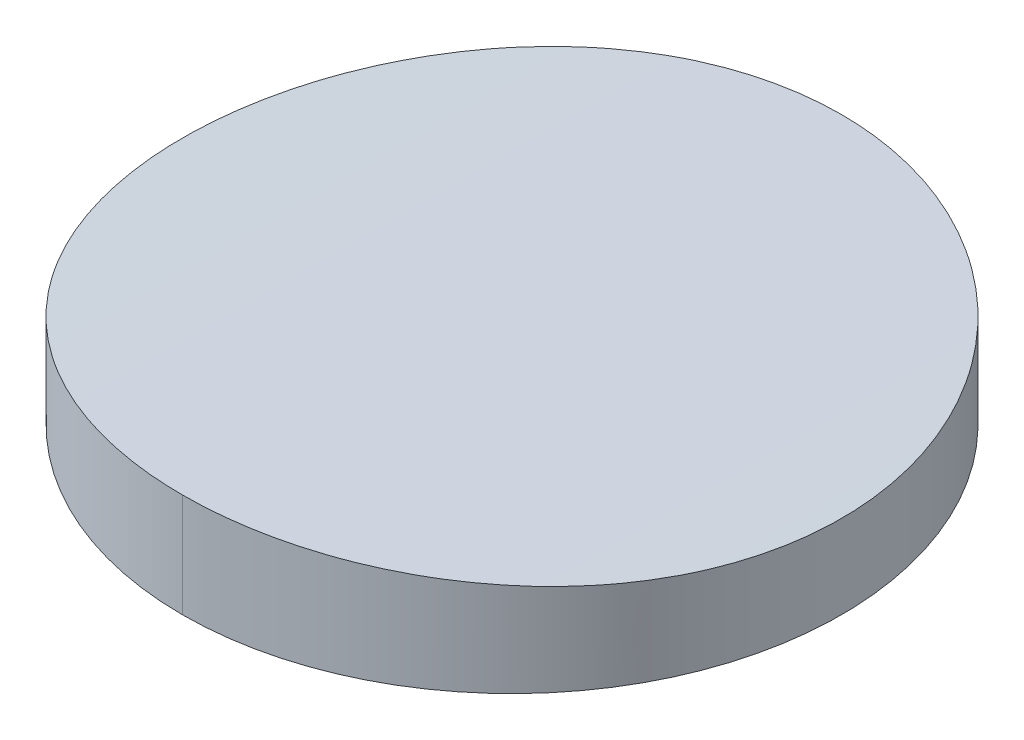
ISO-10303-21;
HEADER;
FILE_DESCRIPTION(('STEP AP214'),'2;1');
FILE_NAME('part.step','',(''),(''),'','','');
FILE_SCHEMA(('AUTOMOTIVE_DESIGN { 1 0 10303 214 1 1 1 1 }'));
ENDSEC;
DATA;
#1=APPLICATION_CONTEXT('core data for automotive mechanical design processes');
#2=APPLICATION_PROTOCOL_DEFINITION('international standard','automotive_design',2000,#1);
#3=PRODUCT_CONTEXT('',#1,'mechanical');
#4=PRODUCT('Part','Part','',(#3));
#5=PRODUCT_RELATED_PRODUCT_CATEGORY('part','',(#4));
#6=PRODUCT_DEFINITION_FORMATION('','',#4);
#7=PRODUCT_DEFINITION_CONTEXT('part definition',#1,'design');
#8=PRODUCT_DEFINITION('design','',#6,#7);
#9=PRODUCT_DEFINITION_SHAPE('','',#8);
#10=(LENGTH_UNIT() NAMED_UNIT(*) SI_UNIT(.MILLI.,.METRE.));
#11=(NAMED_UNIT(*) PLANE_ANGLE_UNIT() SI_UNIT($,.RADIAN.));
#12=(NAMED_UNIT(*) SI_UNIT($,.STERADIAN.) SOLID_ANGLE_UNIT());
#13=UNCERTAINTY_MEASURE_WITH_UNIT(LENGTH_MEASURE(1.E-05),#10,'distance_accuracy_value','');
#14=(GEOMETRIC_REPRESENTATION_CONTEXT(3) GLOBAL_UNCERTAINTY_ASSIGNED_CONTEXT((#13)) GLOBAL_UNIT_ASSIGNED_CONTEXT((#10,
#11,#12)) REPRESENTATION_CONTEXT('',''));
#15=CARTESIAN_POINT('',(0.,0.,0.));
#16=DIRECTION('',(0.,0.,1.));
#17=DIRECTION('',(1.,0.,0.));
#18=AXIS2_PLACEMENT_3D('',#15,#16,#17);
#19=CARTESIAN_POINT('',(0.,2.,0.));
#20=DIRECTION('',(0.,-1.,0.));
#21=DIRECTION('',(0.,0.,-1.));
#22=AXIS2_PLACEMENT_3D('',#19,#20,#21);
#23=CYLINDRICAL_SURFACE('',#22,6.35);
#24=CARTESIAN_POINT('',(0.,1.99999999999999,6.35));
#25=CARTESIAN_POINT('',(0.103842853528296,2.00000108939403,6.35000873743789));
#26=CARTESIAN_POINT('',(0.207687042817171,1.99968705312045,6.34747682567943));
#27=CARTESIAN_POINT('',(0.414884391595368,1.9984379540779,6.33733458540327));
#28=CARTESIAN_POINT('',(0.518238131030155,1.99750431744744,6.32973591888034));
#29=CARTESIAN_POINT('',(0.724451198514081,1.99502503346966,6.30946200413632));
#30=CARTESIAN_POINT('',(0.827310469644072,1.99347931729502,6.29678618499599));
#31=CARTESIAN_POINT('',(1.03253144188486,1.98978649196356,6.26637339123771));
#32=CARTESIAN_POINT('',(1.13489123297501,1.98763787539123,6.24862372851511));
#33=CARTESIAN_POINT('',(1.33889627754905,1.98275443699788,6.20811643418848));
#34=CARTESIAN_POINT('',(1.44053876224624,1.98001800602823,6.18534505091903));
#35=CARTESIAN_POINT('',(1.64234540382485,1.97399568652462,6.13488105520925));
#36=CARTESIAN_POINT('',(1.742512279958,1.970710997741,6.10719918025153));
#37=CARTESIAN_POINT('',(1.9413670229993,1.96361911423562,6.0469264741245));
#38=CARTESIAN_POINT('',(2.04005450755625,1.9598117869342,6.0143343971608));
#39=CARTESIAN_POINT('',(2.23595140438288,1.95170109786126,5.94425371703567));
#40=CARTESIAN_POINT('',(2.3331561652157,1.94739643847559,5.90675226907841));
#41=CARTESIAN_POINT('',(2.52555171552343,1.93834225195972,5.82708588624282));
#42=CARTESIAN_POINT('',(2.62074357953148,1.93359296992572,5.78492351838445));
#43=CARTESIAN_POINT('',(2.80871405649182,1.92370494964381,5.69606761075279));
#44=CARTESIAN_POINT('',(2.90149748050205,1.91856708350654,5.64938415534884));
#45=CARTESIAN_POINT('',(3.08465470283176,1.90794163753951,5.55149781466281));
#46=CARTESIAN_POINT('',(3.17502796272005,1.9024539804794,5.50029393034766));
#47=CARTESIAN_POINT('',(3.3533702503885,1.89116746264935,5.39337823744992));
#48=CARTESIAN_POINT('',(3.44133233859537,1.88536782222045,5.33765493994725));
#49=CARTESIAN_POINT('',(3.61408856255866,1.87354720326617,5.22222365906147));
#50=CARTESIAN_POINT('',(3.69889372150536,1.86752717682495,5.1625320743307));
#51=CARTESIAN_POINT('',(3.8652709772437,1.85531820708541,5.03921133294866));
#52=CARTESIAN_POINT('',(3.94685017709921,1.84912969215878,4.97559172012224));
#53=CARTESIAN_POINT('',(4.10678341026481,1.83662997819599,4.84442554248109));
#54=CARTESIAN_POINT('',(4.18513732085295,1.83031877450497,4.77687882847599));
#55=CARTESIAN_POINT('',(4.33862927917859,1.81761782743431,4.63786851051239));
#56=CARTESIAN_POINT('',(4.41375907888108,1.81122793085914,4.56639581649589));
#57=CARTESIAN_POINT('',(4.5608517690741,1.79840817737677,4.41950205175944));
#58=CARTESIAN_POINT('',(4.63279576781628,1.79197828814912,4.34406206494087));
#59=CARTESIAN_POINT('',(4.77269646472146,1.77919442396298,4.18992384877719));
#60=CARTESIAN_POINT('',(4.84066306515828,1.7728402948393,4.11123462269958));
#61=CARTESIAN_POINT('',(4.97262056012919,1.76025502496192,3.95060723200545));
#62=CARTESIAN_POINT('',(5.03661224119402,1.75402386004443,3.86866971542962));
#63=CARTESIAN_POINT('',(5.16063299400014,1.7417284809773,3.70155453452372));
#64=CARTESIAN_POINT('',(5.22065296331906,1.73566466771221,3.6163700876243));
#65=CARTESIAN_POINT('',(5.33618136526156,1.72380259924905,3.44360506821389));
#66=CARTESIAN_POINT('',(5.39171117185556,1.71800315127833,3.35603886988897));
#67=CARTESIAN_POINT('',(5.49827143955425,1.70671302159509,3.17851523133362));
#68=CARTESIAN_POINT('',(5.54931374262552,1.70122154198214,3.08856495309264));
#69=CARTESIAN_POINT('',(5.64691272928603,1.69058677684858,2.9062808108221));
#70=CARTESIAN_POINT('',(5.69347087522368,1.68544337797763,2.81394773639676));
#71=CARTESIAN_POINT('',(5.78211632292745,1.67554035207542,2.62690481994584));
#72=CARTESIAN_POINT('',(5.82419412626258,1.67078154533751,2.53219043471913));
#73=CARTESIAN_POINT('',(5.9039568739437,1.66167228727416,2.34022936014354));
#74=CARTESIAN_POINT('',(5.94161339308422,1.65732450998601,2.24297073038601));
#75=CARTESIAN_POINT('',(6.01199206450491,1.64913017005306,2.04695987372984));
#76=CARTESIAN_POINT('',(6.04472728200034,1.64528228411336,1.9482123957892));
#77=CARTESIAN_POINT('',(6.10527804367,1.63811482737222,1.74922952208899));
#78=CARTESIAN_POINT('',(6.13309486041466,1.634795119934,1.64899451850344));
#79=CARTESIAN_POINT('',(6.18382513452612,1.62870648590376,1.44704135198037));
#80=CARTESIAN_POINT('',(6.20672769424668,1.62593878435455,1.34532041628709));
#81=CARTESIAN_POINT('',(6.24749004763409,1.62099110073572,1.14113498340212));
#82=CARTESIAN_POINT('',(6.26536283994373,1.61880960438281,1.03867311803696));
#83=CARTESIAN_POINT('',(6.29600845509256,1.61505742083034,0.833220133840947));
#84=CARTESIAN_POINT('',(6.30879299130521,1.61348533097205,0.7302307898939));
#85=CARTESIAN_POINT('',(6.32927640983017,1.61096184213555,0.523726321825312));
#86=CARTESIAN_POINT('',(6.33697461589062,1.61001052569234,0.420211129632656));
#87=CARTESIAN_POINT('',(6.34730169783784,1.60873354147357,0.21265682224641));
#88=CARTESIAN_POINT('',(6.34991741574074,1.60840949764358,0.108617044428807));
#89=CARTESIAN_POINT('',(6.35007922653205,1.60838946433526,-0.0993878774418051));
#90=CARTESIAN_POINT('',(6.34762915838904,1.60869299926337,-0.203353018327471));
#91=CARTESIAN_POINT('',(6.33762069143978,1.60993068153884,-0.410822070082934));
#92=CARTESIAN_POINT('',(6.33007270094894,1.6108635439976,-0.514326489032958));
#93=CARTESIAN_POINT('',(6.30988301744227,1.61335122336833,-0.720873449674944));
#94=CARTESIAN_POINT('',(6.29723919117438,1.61490630075401,-0.823915779634936));
#95=CARTESIAN_POINT('',(6.26686985131586,1.61862548350432,-1.02953951228668));
#96=CARTESIAN_POINT('',(6.24912983979097,1.62079132608326,-1.13211873966093));
#97=CARTESIAN_POINT('',(6.20864727729392,1.62570646671817,-1.33644144177248));
#98=CARTESIAN_POINT('',(6.18589678930965,1.62845669023619,-1.43818332179295));
#99=CARTESIAN_POINT('',(6.13545899020578,1.63451243344224,-1.64020394236672));
#100=CARTESIAN_POINT('',(6.10778163121777,1.63781683294681,-1.74048519960146));
#101=CARTESIAN_POINT('',(6.04750110302257,1.64495544864487,-1.93958670790782));
#102=CARTESIAN_POINT('',(6.01489569773193,1.64878990528211,-2.03840627328045));
#103=CARTESIAN_POINT('',(5.94476858609234,1.65695915555922,-2.2345878970721));
#104=CARTESIAN_POINT('',(5.90723286324355,1.66129537131047,-2.3319448832787));
#105=CARTESIAN_POINT('',(5.82772140293325,1.67038125549509,-2.52406671857803));
#106=CARTESIAN_POINT('',(5.78577609363014,1.67512805497993,-2.61884429843097));
#107=CARTESIAN_POINT('',(5.69738361606861,1.68500942104217,-2.80602924163084));
#108=CARTESIAN_POINT('',(5.65094542050803,1.69014321041304,-2.89844088132842));
#109=CARTESIAN_POINT('',(5.55357562190587,1.70076096181474,-3.08089831350808));
#110=CARTESIAN_POINT('',(5.50264201636315,1.70624507959746,-3.17094302821704));
#111=CARTESIAN_POINT('',(5.39628882170818,1.71752263984193,-3.34867207449418));
#112=CARTESIAN_POINT('',(5.34085685203867,1.7233169199448,-3.43634894127204));
#113=CARTESIAN_POINT('',(5.22555009930528,1.73516704194532,-3.60929115866195));
#114=CARTESIAN_POINT('',(5.16565626307002,1.74122395324804,-3.69454373319206));
#115=CARTESIAN_POINT('',(5.04187819021232,1.75350778237981,-3.86180711310454));
#116=CARTESIAN_POINT('',(4.9780027354592,1.75973431012718,-3.94382444384833));
#117=CARTESIAN_POINT('',(4.84626874227925,1.77231246673427,-4.10462380305244));
#118=CARTESIAN_POINT('',(4.77840909586331,1.77866413006432,-4.18340492108195));
#119=CARTESIAN_POINT('',(4.63871370435611,1.79144515868848,-4.33773968855298));
#120=CARTESIAN_POINT('',(4.56686774330287,1.79787468717572,-4.41328407461273));
#121=CARTESIAN_POINT('',(4.41996610170922,1.81069536008278,-4.56038951495972));
#122=CARTESIAN_POINT('',(4.34492938507969,1.81708652782399,-4.63196950613109));
#123=CARTESIAN_POINT('',(4.19161057331683,1.82979229867648,-4.7712024712576));
#124=CARTESIAN_POINT('',(4.11333646997175,1.8361070457813,-4.83886422923584));
#125=CARTESIAN_POINT('',(3.95355026373785,1.84861595557127,-4.97026896159358));
#126=CARTESIAN_POINT('',(3.87203802058353,1.85481011301552,-5.03401176591162));
#127=CARTESIAN_POINT('',(3.70578237583982,1.86703231364653,-5.15758789482105));
#128=CARTESIAN_POINT('',(3.62103160926085,1.87305991697375,-5.21741135102347));
#129=CARTESIAN_POINT('',(3.4484493233364,1.88489215454168,-5.33305970384822));
#130=CARTESIAN_POINT('',(3.36060911943036,1.89069604487549,-5.38887171770212));
#131=CARTESIAN_POINT('',(3.18249904931388,1.90199337983068,-5.49597562701724));
#132=CARTESIAN_POINT('',(3.09223591798248,1.90748757522978,-5.54727863882778));
#133=CARTESIAN_POINT('',(2.90928774100713,1.91812825261145,-5.64537450180338));
#134=CARTESIAN_POINT('',(2.81660303994356,1.92327478369567,-5.69216799026164));
#135=CARTESIAN_POINT('',(2.6288189577784,1.93318213722491,-5.78125576859611));
#136=CARTESIAN_POINT('',(2.53371458563608,1.93794206019387,-5.82353963414072));
#137=CARTESIAN_POINT('',(2.34146336786741,1.94702023787441,-5.90346509582901));
#138=CARTESIAN_POINT('',(2.24431492944889,1.95133813152451,-5.94110290202965));
#139=CARTESIAN_POINT('',(2.04851563935079,1.95947674749641,-6.01145973353593));
#140=CARTESIAN_POINT('',(1.94986932298999,1.96329872672443,-6.04419122807146));
#141=CARTESIAN_POINT('',(1.75108210425915,1.9704211139974,-6.10474682096438));
#142=CARTESIAN_POINT('',(1.65094146729133,1.97372161348215,-6.13257177976674));
#143=CARTESIAN_POINT('',(1.44917260410553,1.97977650169365,-6.18332634459668));
#144=CARTESIAN_POINT('',(1.34754154452888,1.98252964861432,-6.20624482790098));
#145=CARTESIAN_POINT('',(1.14285508514186,1.98746369696815,-6.24718541659045));
#146=CARTESIAN_POINT('',(1.03979558064753,1.9896422325704,-6.26518728941311));
#147=CARTESIAN_POINT('',(0.833160217801213,1.99338673714968,-6.29603181654224));
#148=CARTESIAN_POINT('',(0.729586308061618,1.99495423185173,-6.3088873231471));
#149=CARTESIAN_POINT('',(0.521929207974264,1.99746861790253,-6.32944876587431));
#150=CARTESIAN_POINT('',(0.417846055912314,1.99841555520503,-6.33715508330721));
#151=CARTESIAN_POINT('',(0.209175204886232,1.99968255300381,-6.34744131483319));
#152=CARTESIAN_POINT('',(0.104586894747561,2.00000112115779,-6.35000902522629));
#153=CARTESIAN_POINT('',(0.,1.99999999999999,-6.35));
#154=B_SPLINE_CURVE_WITH_KNOTS('',3,(#24,#25,#26,#27,#28,#29,#30,#31,#32,#33,#34,#35,#36,#37,
#38,#39,#40,#41,#42,#43,#44,#45,#46,#47,#48,#49,#50,#51,#52,#53,#54,#55,#56,#57,#58,#59,#60,#61,
#62,#63,#64,#65,#66,#67,#68,#69,#70,#71,#72,#73,#74,#75,#76,#77,#78,#79,#80,#81,#82,#83,#84,#85,
#86,#87,#88,#89,#90,#91,#92,#93,#94,#95,#96,#97,#98,#99,#100,#101,#102,#103,#104,#105,#106,#107,
#108,#109,#110,#111,#112,#113,#114,#115,#116,#117,#118,#119,#120,#121,#122,#123,#124,#125,#126,
#127,#128,#129,#130,#131,#132,#133,#134,#135,#136,#137,#138,#139,#140,#141,#142,#143,#144,#145,
#146,#147,#148,#149,#150,#151,#152,#153),.UNSPECIFIED.,.F.,.F.,(4,2,2,2,2,2,2,2,2,2,2,2,2,2,2,2,
2,2,2,2,2,2,2,2,2,2,2,2,2,2,2,2,2,2,2,2,2,2,2,2,2,2,2,2,2,2,2,2,2,2,2,2,2,2,2,2,2,2,2,2,2,2,2,2,
4),(0.,0.311498811956988,0.622283120134887,0.933102385421158,1.24470581647047,1.55717339074705,
1.86896594882081,2.18083774713863,2.49354246878575,2.80607581712584,3.11792744226902,
3.42984816124483,3.74258829356827,4.05410797327817,4.36489847093678,4.67570078323595,
4.98725582282436,5.30046184733388,5.61285166065542,5.92517946213526,6.23819989975789,
6.54962985152012,6.86021163205849,7.17069178198739,7.4818175739369,7.79484523111016,
8.1070265926924,8.41912706294654,8.73191264032906,9.04388228967181,9.35512955962018,
9.66641820305434,9.97851166924205,10.2903687105481,10.6015909572762,10.912943625447,
11.2251909720889,11.5379365484982,11.8500574123352,12.16232032745,12.4754910139479,
12.7866272235223,13.0971544117969,13.4078206307989,13.7193729306648,14.032341682165,
14.3446430300216,14.657031642939,14.9702615584749,15.2818365433853,15.5926835923901,
15.903544120973,16.2151594481444,16.5277345288096,16.8395160136561,17.1512533722218,
17.4636963914653,17.7763926197094,18.0882801518701,18.400112934705,18.7126453111698,
19.0264450618196,19.3394561800131,19.6524441163672,19.9661744911775),.UNSPECIFIED.);
#155=CARTESIAN_POINT('',(0.,2.,6.35));
#156=VERTEX_POINT('',#155);
#157=CARTESIAN_POINT('',(0.,2.,-6.35));
#158=VERTEX_POINT('',#157);
#159=EDGE_CURVE('E41',#156,#158,#154,.T.);
#160=ORIENTED_EDGE('',*,*,#159,.F.);
#161=DIRECTION('',(0.,-1.,0.));
#162=VECTOR('',#161,1.);
#163=CARTESIAN_POINT('',(0.,2.,6.35));
#164=LINE('',#163,#162);
#165=CARTESIAN_POINT('',(0.,0.,6.35));
#166=VERTEX_POINT('',#165);
#167=EDGE_CURVE('E11',#156,#166,#164,.T.);
#168=ORIENTED_EDGE('',*,*,#167,.T.);
#169=CARTESIAN_POINT('',(0.,0.,0.));
#170=DIRECTION('',(0.,1.,0.));
#171=DIRECTION('',(0.,0.,1.));
#172=AXIS2_PLACEMENT_3D('',#169,#170,#171);
#173=CIRCLE('',#172,6.35);
#174=CARTESIAN_POINT('',(0.,0.,-6.35));
#175=VERTEX_POINT('',#174);
#176=EDGE_CURVE('E28',#166,#175,#173,.T.);
#177=ORIENTED_EDGE('',*,*,#176,.T.);
#178=DIRECTION('',(0.,-1.,0.));
#179=VECTOR('',#178,1.);
#180=CARTESIAN_POINT('',(0.,2.,-6.35));
#181=LINE('',#180,#179);
#182=EDGE_CURVE('E52',#158,#175,#181,.T.);
#183=ORIENTED_EDGE('',*,*,#182,.F.);
#184=EDGE_LOOP('',(#160,#168,#177,#183));
#185=FACE_BOUND('',#184,.T.);
#186=ADVANCED_FACE('F16',(#185),#23,.T.);
#187=CARTESIAN_POINT('',(0.,-49.68,6.35));
#188=DIRECTION('',(0.,0.,-1.));
#189=DIRECTION('',(-1.,0.,0.));
#190=AXIS2_PLACEMENT_3D('',#187,#188,#189);
#191=CYLINDRICAL_SURFACE('',#190,51.68);
#192=CARTESIAN_POINT('',(0.,1.99999999999999,-6.35));
#193=CARTESIAN_POINT('',(-0.104031730697626,2.00000109737317,-6.35000880077087));
#194=CARTESIAN_POINT('',(-0.208064810319357,1.99968591379695,-6.34746772929659));
#195=CARTESIAN_POINT('',(-0.415637226400372,1.99843227711319,-6.3372887402424));
#196=CARTESIAN_POINT('',(-0.519177148170167,1.99749526070797,-6.32966257124011));
#197=CARTESIAN_POINT('',(-0.725759848586946,1.99500704028166,-6.3093152349574));
#198=CARTESIAN_POINT('',(-0.828802569957018,1.99345576713163,-6.29659349421547));
#199=CARTESIAN_POINT('',(-1.03438770283717,1.98974972828027,-6.26607055656863));
#200=CARTESIAN_POINT('',(-1.13692818717416,1.98759344460975,-6.2482565811236));
#201=CARTESIAN_POINT('',(-1.34124320684537,1.98269382198764,-6.20761218172376));
#202=CARTESIAN_POINT('',(-1.44301541633037,1.97994913409907,-6.18477022767651));
#203=CARTESIAN_POINT('',(-1.64507508238146,1.97390907049309,-6.1341523503749));
#204=CARTESIAN_POINT('',(-1.74536527764327,1.97061490054526,-6.1063872221826));
#205=CARTESIAN_POINT('',(-1.94446021132084,1.96350297584576,-6.0459353276017));
#206=CARTESIAN_POINT('',(-2.04326456473174,1.95968508789878,-6.01324730898446));
#207=CARTESIAN_POINT('',(-2.2393888640337,1.95155233899996,-5.94296217897696));
#208=CARTESIAN_POINT('',(-2.3367041261814,1.94723617455726,-5.90535215568441));
#209=CARTESIAN_POINT('',(-2.52880118592172,1.93818240848955,-5.82566904285189));
#210=CARTESIAN_POINT('',(-2.623594476734,1.93344742093748,-5.78362335928518));
#211=CARTESIAN_POINT('',(-2.81078584106369,1.92359143699134,-5.69503713799783));
#212=CARTESIAN_POINT('',(-2.90318865210334,1.91847129772098,-5.64850651974713));
#213=CARTESIAN_POINT('',(-3.08560265291217,1.90788428626843,-5.55096210326502));
#214=CARTESIAN_POINT('',(-3.17561331009709,1.9024173377759,-5.49994731739872));
#215=CARTESIAN_POINT('',(-3.35324815536693,1.89117478593464,-5.39344580822187));
#216=CARTESIAN_POINT('',(-3.44086550952743,1.88539841501511,-5.33794777233746));
#217=CARTESIAN_POINT('',(-3.6137507183761,1.87357166358353,-5.22246842476983));
#218=CARTESIAN_POINT('',(-3.69900363970799,1.86751999179172,-5.16246488710079));
#219=CARTESIAN_POINT('',(-3.86624076374883,1.85524615827787,-5.03847994927963));
#220=CARTESIAN_POINT('',(-3.94823222402922,1.84902443388325,-4.9745082981723));
#221=CARTESIAN_POINT('',(-4.10895444079161,1.83645748089197,-4.84259778754771));
#222=CARTESIAN_POINT('',(-4.18768507506634,1.83011224767961,-4.77465877957377));
#223=CARTESIAN_POINT('',(-4.34189532680687,1.81734310488225,-4.63482389975099));
#224=CARTESIAN_POINT('',(-4.41736651943915,1.81091904079415,-4.56291875408469));
#225=CARTESIAN_POINT('',(-4.56437128961005,1.79809564839199,-4.41585544477431));
#226=CARTESIAN_POINT('',(-4.63592148427123,1.79169634330444,-4.34071388866511));
#227=CARTESIAN_POINT('',(-4.77507051161946,1.77897367141708,-4.18720449432699));
#228=CARTESIAN_POINT('',(-4.84267907201103,1.77265015117955,-4.10884548962064));
#229=CARTESIAN_POINT('',(-4.97395630959522,1.76012544450857,-3.94891051472541));
#230=CARTESIAN_POINT('',(-5.03762576252585,1.75392423415326,-3.86733518314972));
#231=CARTESIAN_POINT('',(-5.16103748583995,1.74168751343236,-3.70097614232819));
#232=CARTESIAN_POINT('',(-5.22077082487729,1.73565239685853,-3.61618578073109));
#233=CARTESIAN_POINT('',(-5.33628236885542,1.72379239790438,-3.4434620903102));
#234=CARTESIAN_POINT('',(-5.39204441319966,1.71796841716847,-3.35551789084783));
#235=CARTESIAN_POINT('',(-5.4990296172657,1.70663211461501,-3.17721955661798));
#236=CARTESIAN_POINT('',(-5.55026482016905,1.70111898090589,-3.08687270259477));
#237=CARTESIAN_POINT('',(-5.64821020074515,1.69044430260828,-2.90377668365903));
#238=CARTESIAN_POINT('',(-5.69492186248767,1.68528264287537,-2.81102831936959));
#239=CARTESIAN_POINT('',(-5.78383528664379,1.67534690311099,-2.62313622930078));
#240=CARTESIAN_POINT('',(-5.82602738063838,1.67057365903211,-2.52798788584952));
#241=CARTESIAN_POINT('',(-5.90577255798521,1.66146337500205,-2.33563921678357));
#242=CARTESIAN_POINT('',(-5.94332116976818,1.65712675624651,-2.23843701718063));
#243=CARTESIAN_POINT('',(-6.01349166956566,1.64895443286497,-2.04254484145805));
#244=CARTESIAN_POINT('',(-6.04612657111211,1.64511740889014,-1.94385958459497));
#245=CARTESIAN_POINT('',(-6.10648434678511,1.63797124240753,-1.74500703744601));
#246=CARTESIAN_POINT('',(-6.13420847905353,1.63466196471257,-1.64484013390524));
#247=CARTESIAN_POINT('',(-6.18476098067905,1.62859364265596,-1.44302899852723));
#248=CARTESIAN_POINT('',(-6.20757847808967,1.62583582111946,-1.34138200818024));
#249=CARTESIAN_POINT('',(-6.24816890178472,1.62090838810155,-1.13739939441836));
#250=CARTESIAN_POINT('',(-6.26595724925904,1.61873697940424,-1.03506688321106));
#251=CARTESIAN_POINT('',(-6.296447613544,1.61500349272156,-0.829876562160359));
#252=CARTESIAN_POINT('',(-6.30916128035183,1.61344001930875,-0.727020510914648));
#253=CARTESIAN_POINT('',(-6.32951656568174,1.61093219353953,-0.520786549636441));
#254=CARTESIAN_POINT('',(-6.33715751065735,1.60998792339996,-0.417408572138997));
#255=CARTESIAN_POINT('',(-6.34738349289418,1.60872341345236,-0.210132656969671));
#256=CARTESIAN_POINT('',(-6.34995544201722,1.60840478906836,-0.106234065907489));
#257=CARTESIAN_POINT('',(-6.35004388728766,1.6083938402334,0.102006736622783));
#258=CARTESIAN_POINT('',(-6.34753887537476,1.60870418033028,0.206348958890645));
#259=CARTESIAN_POINT('',(-6.33738372444039,1.60995996888244,0.414564916159729));
#260=CARTESIAN_POINT('',(-6.32974416127531,1.61090411186188,0.518439173201028));
#261=CARTESIAN_POINT('',(-6.30933458112527,1.6134187086517,0.725718574257027));
#262=CARTESIAN_POINT('',(-6.29656241623203,1.61498942467045,0.829123503521671));
#263=CARTESIAN_POINT('',(-6.26589995545992,1.61874400558918,1.03546533490699));
#264=CARTESIAN_POINT('',(-6.24799496876585,1.62092963010008,1.1384000194939));
#265=CARTESIAN_POINT('',(-6.20732130664404,1.62586691131816,1.34254674188671));
#266=CARTESIAN_POINT('',(-6.18458725657574,1.6286145334455,1.44376577767289));
#267=CARTESIAN_POINT('',(-6.13423157640339,1.63465915515257,1.64475254241095));
#268=CARTESIAN_POINT('',(-6.10661967813236,1.63795506009907,1.74452274080255));
#269=CARTESIAN_POINT('',(-6.04651928151345,1.64507107138031,1.94261391425945));
#270=CARTESIAN_POINT('',(-6.01402856761006,1.6488914158042,2.04093420850537));
#271=CARTESIAN_POINT('',(-5.94417970737197,1.65702724690158,2.23612886075043));
#272=CARTESIAN_POINT('',(-5.90680779688501,1.66134412945792,2.33299823230669));
#273=CARTESIAN_POINT('',(-5.82726232630916,1.67043352764143,2.52514941795839));
#274=CARTESIAN_POINT('',(-5.78507130054357,1.67520768978536,2.62042392414671));
#275=CARTESIAN_POINT('',(-5.69614077071141,1.68514749547786,2.80857429309407));
#276=CARTESIAN_POINT('',(-5.64941044948104,1.6903123441807,2.90145453655758));
#277=CARTESIAN_POINT('',(-5.55140976464166,1.70099531918252,3.08482085497303));
#278=CARTESIAN_POINT('',(-5.50013737469702,1.70651360285088,3.17530583771809));
#279=CARTESIAN_POINT('',(-5.39306024855597,1.71786189049971,3.35388735609509));
#280=CARTESIAN_POINT('',(-5.33724289041864,1.72369274607121,3.44197626656132));
#281=CARTESIAN_POINT('',(-5.22159651800825,1.73556863223763,3.61499974688742));
#282=CARTESIAN_POINT('',(-5.16178285237725,1.74161280559234,3.6999446351901));
#283=CARTESIAN_POINT('',(-5.03819062425352,1.75386901768561,3.86660774389969));
#284=CARTESIAN_POINT('',(-4.97442073811067,1.76008067329555,3.94833242438582));
#285=CARTESIAN_POINT('',(-4.84292344885567,1.77262729531994,4.10856153065536));
#286=CARTESIAN_POINT('',(-4.77519495193506,1.77896229549033,4.18706505610168));
#287=CARTESIAN_POINT('',(-4.63578728299306,1.79170861169083,4.3408595252387));
#288=CARTESIAN_POINT('',(-4.56409801863684,1.7981200866404,4.41614130450188));
#289=CARTESIAN_POINT('',(-4.4172143509019,1.81093171108529,4.5630584438099));
#290=CARTESIAN_POINT('',(-4.34202341389106,1.81733186553408,4.63469726902156));
#291=CARTESIAN_POINT('',(-4.18838959788397,1.83005453897355,4.77403393894188));
#292=CARTESIAN_POINT('',(-4.10995475719086,1.83637720481186,4.84174063032834));
#293=CARTESIAN_POINT('',(-3.94984047360216,1.84890071144042,4.97322130677493));
#294=CARTESIAN_POINT('',(-3.8681608948841,1.85510154711468,5.03699512692203));
#295=CARTESIAN_POINT('',(-3.70156404287035,1.86733567864506,5.16061942321022));
#296=CARTESIAN_POINT('',(-3.61663937393702,1.87336853004377,5.22045997362187));
#297=CARTESIAN_POINT('',(-3.44369150645689,1.88521043585716,5.33613644790323));
#298=CARTESIAN_POINT('',(-3.35565919510135,1.89101870543915,5.39195882875755));
#299=CARTESIAN_POINT('',(-3.17716169673725,1.90232273948727,5.49906636778159));
#300=CARTESIAN_POINT('',(-3.08670327839579,1.90781926232746,5.55036272167407));
#301=CARTESIAN_POINT('',(-2.90336137128455,1.91846241063961,5.64842820126673));
#302=CARTESIAN_POINT('',(-2.81047822930036,1.92360908577169,5.6951979699067));
#303=CARTESIAN_POINT('',(-2.62229412397858,1.93351441900015,5.78422142794079));
#304=CARTESIAN_POINT('',(-2.52698814935042,1.93827216947798,5.82646462139162));
#305=CARTESIAN_POINT('',(-2.33488593724737,1.94731747279453,5.90606198583026));
#306=CARTESIAN_POINT('',(-2.23809937002592,1.95160722926497,5.94343924559825));
#307=CARTESIAN_POINT('',(-2.04303996889112,1.95969297572285,6.01331453712117));
#308=CARTESIAN_POINT('',(-1.94477158424585,1.96349020404882,6.0458248386871));
#309=CARTESIAN_POINT('',(-1.74675634494498,1.97056684449768,6.10597749012262));
#310=CARTESIAN_POINT('',(-1.647009750966,1.97384634675848,6.13362068746884));
#311=CARTESIAN_POINT('',(-1.44604497345006,1.97986335587829,6.1840509244119));
#312=CARTESIAN_POINT('',(-1.34482400969009,1.98259964070047,6.20682702344587));
#313=CARTESIAN_POINT('',(-1.14073761978392,1.987510123106,6.2475691440342));
#314=CARTESIAN_POINT('',(-1.03786583834378,1.98968065030537,6.26550378184413));
#315=CARTESIAN_POINT('',(-0.831608893725963,1.99341135048957,6.29623318270686));
#316=CARTESIAN_POINT('',(-0.728225661145961,1.99497303823995,6.30904070395867));
#317=CARTESIAN_POINT('',(-0.520952801442679,1.99747808494281,6.32952542008064));
#318=CARTESIAN_POINT('',(-0.417063212420179,1.99842148971588,6.33720299512895));
#319=CARTESIAN_POINT('',(-0.208782350750662,1.99968374415694,6.34745081840049));
#320=CARTESIAN_POINT('',(-0.104390472722356,2.00000111283036,6.35000895593291));
#321=CARTESIAN_POINT('',(0.,1.99999999999999,6.35));
#322=B_SPLINE_CURVE_WITH_KNOTS('',3,(#192,#193,#194,#195,#196,#197,#198,#199,#200,#201,#202,
#203,#204,#205,#206,#207,#208,#209,#210,#211,#212,#213,#214,#215,#216,#217,#218,#219,#220,#221,
#222,#223,#224,#225,#226,#227,#228,#229,#230,#231,#232,#233,#234,#235,#236,#237,#238,#239,#240,
#241,#242,#243,#244,#245,#246,#247,#248,#249,#250,#251,#252,#253,#254,#255,#256,#257,#258,#259,
#260,#261,#262,#263,#264,#265,#266,#267,#268,#269,#270,#271,#272,#273,#274,#275,#276,#277,#278,
#279,#280,#281,#282,#283,#284,#285,#286,#287,#288,#289,#290,#291,#292,#293,#294,#295,#296,#297,
#298,#299,#300,#301,#302,#303,#304,#305,#306,#307,#308,#309,#310,#311,#312,#313,#314,#315,#316,
#317,#318,#319,#320,#321),.UNSPECIFIED.,.F.,.F.,(4,2,2,2,2,2,2,2,2,2,2,2,2,2,2,2,2,2,2,2,2,2,2,
2,2,2,2,2,2,2,2,2,2,2,2,2,2,2,2,2,2,2,2,2,2,2,2,2,2,2,2,2,2,2,2,2,2,2,2,2,2,2,2,2,4),(0.,
0.312065289929065,0.623412072866449,0.934793904978929,1.24696408861602,1.559857736044,
1.87207359860743,2.18436901363443,2.49750074126941,2.80880001435124,3.11942592136088,
3.43012041576963,3.74162496107432,4.0547823651685,4.36719872678839,4.67962678638649,
4.99281920033337,5.30456116272868,5.61549800778197,5.92637342308459,6.23793153651408,
6.55069253065098,6.86259469204192,7.17439417635512,7.48684788515633,7.79960017485976,
8.11150901934581,8.4233378366603,8.7358506316831,9.04739449072681,9.35821896400143,
9.66908469971605,9.98075204409988,10.2937424971319,10.6060902379537,10.9185688274468,
11.2319508573859,11.5431574648852,11.8537500529879,12.1644841155732,12.4761141172336,
12.7889116998567,13.101089184201,13.4134066472878,13.7266231466397,14.0386990660599,
14.3501132408669,14.6616138734566,14.9739485444988,15.2859803425652,15.5972805106971,
15.9085937233951,16.2206645615169,16.533742234336,16.8460223843619,17.1582581139509,
17.4712028460303,17.7826038778037,18.093206132412,18.4037542503052,18.7149932604705,
19.0282038384024,19.3406301120471,19.6530332293426,19.9661745070832),.UNSPECIFIED.);
#323=EDGE_CURVE('E63',#158,#156,#322,.T.);
#324=ORIENTED_EDGE('',*,*,#323,.T.);
#325=ORIENTED_EDGE('',*,*,#159,.T.);
#326=EDGE_LOOP('',(#324,#325));
#327=FACE_BOUND('',#326,.T.);
#328=ADVANCED_FACE('F84',(#327),#191,.T.);
#329=CARTESIAN_POINT('',(0.,2.,0.));
#330=DIRECTION('',(0.,-1.,0.));
#331=DIRECTION('',(0.,0.,-1.));
#332=AXIS2_PLACEMENT_3D('',#329,#330,#331);
#333=CYLINDRICAL_SURFACE('',#332,6.35);
#334=ORIENTED_EDGE('',*,*,#167,.F.);
#335=ORIENTED_EDGE('',*,*,#323,.F.);
#336=ORIENTED_EDGE('',*,*,#182,.T.);
#337=CARTESIAN_POINT('',(0.,0.,0.));
#338=DIRECTION('',(0.,1.,0.));
#339=DIRECTION('',(0.,0.,1.));
#340=AXIS2_PLACEMENT_3D('',#337,#338,#339);
#341=CIRCLE('',#340,6.35);
#342=EDGE_CURVE('E61',#175,#166,#341,.T.);
#343=ORIENTED_EDGE('',*,*,#342,.T.);
#344=EDGE_LOOP('',(#334,#335,#336,#343));
#345=FACE_BOUND('',#344,.T.);
#346=ADVANCED_FACE('F59',(#345),#333,.T.);
#347=CARTESIAN_POINT('',(-6.35,0.,6.35));
#348=DIRECTION('',(0.,1.,0.));
#349=DIRECTION('',(1.,0.,0.));
#350=AXIS2_PLACEMENT_3D('',#347,#348,#349);
#351=PLANE('',#350);
#352=ORIENTED_EDGE('',*,*,#342,.F.);
#353=ORIENTED_EDGE('',*,*,#176,.F.);
#354=EDGE_LOOP('',(#352,#353));
#355=FACE_BOUND('',#354,.T.);
#356=ADVANCED_FACE('F70',(#355),#351,.F.);
#357=CLOSED_SHELL('',(#186,#328,#346,#356));
#358=MANIFOLD_SOLID_BREP('B1',#357);
#359=ADVANCED_BREP_SHAPE_REPRESENTATION('',(#18,#358),#14);
#360=SHAPE_DEFINITION_REPRESENTATION(#9,#359);
ENDSEC;
END-ISO-10303-21;
